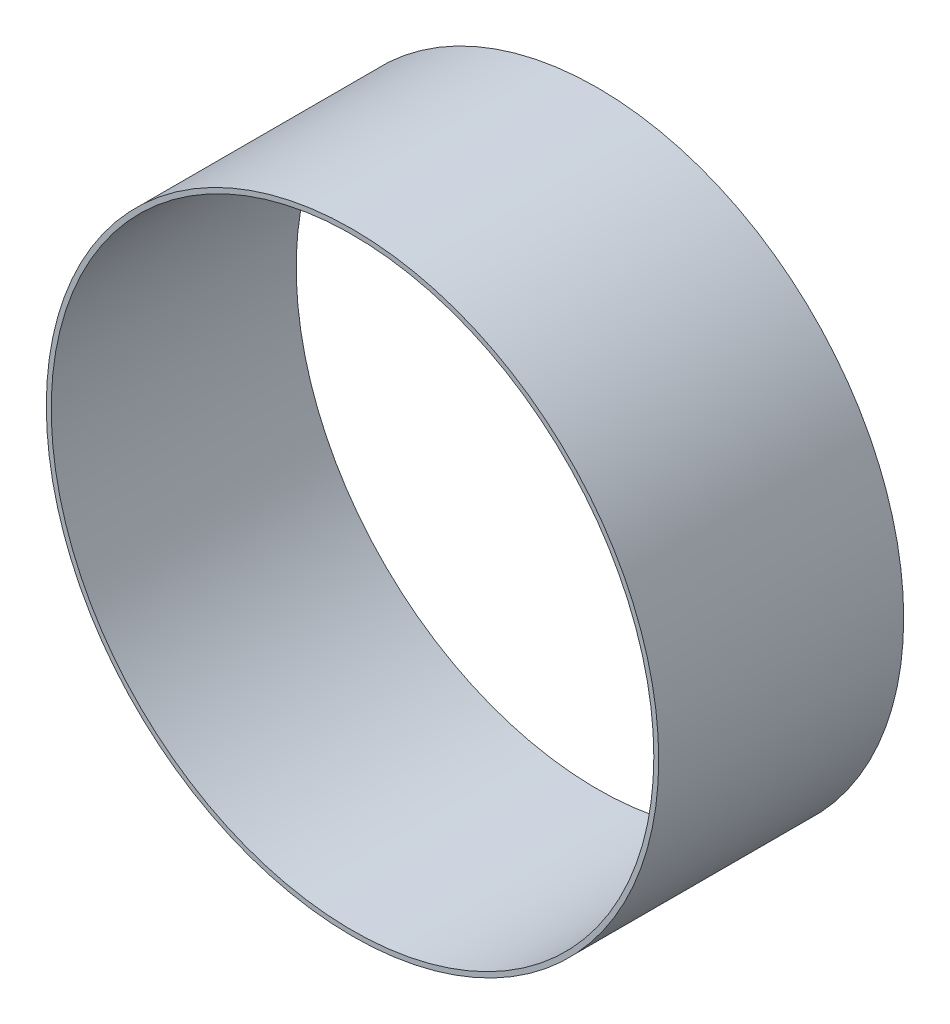
ISO-10303-21;
HEADER;
FILE_DESCRIPTION(('STEP AP214'),'2;1');
FILE_NAME('part.step','',(''),(''),'','','');
FILE_SCHEMA(('AUTOMOTIVE_DESIGN { 1 0 10303 214 1 1 1 1 }'));
ENDSEC;
DATA;
#1=APPLICATION_CONTEXT('core data for automotive mechanical design processes');
#2=APPLICATION_PROTOCOL_DEFINITION('international standard','automotive_design',2000,#1);
#3=PRODUCT_CONTEXT('',#1,'mechanical');
#4=PRODUCT('Part','Part','',(#3));
#5=PRODUCT_RELATED_PRODUCT_CATEGORY('part','',(#4));
#6=PRODUCT_DEFINITION_FORMATION('','',#4);
#7=PRODUCT_DEFINITION_CONTEXT('part definition',#1,'design');
#8=PRODUCT_DEFINITION('design','',#6,#7);
#9=PRODUCT_DEFINITION_SHAPE('','',#8);
#10=(LENGTH_UNIT() NAMED_UNIT(*) SI_UNIT(.MILLI.,.METRE.));
#11=(NAMED_UNIT(*) PLANE_ANGLE_UNIT() SI_UNIT($,.RADIAN.));
#12=(NAMED_UNIT(*) SI_UNIT($,.STERADIAN.) SOLID_ANGLE_UNIT());
#13=UNCERTAINTY_MEASURE_WITH_UNIT(LENGTH_MEASURE(1.E-05),#10,'distance_accuracy_value','');
#14=(GEOMETRIC_REPRESENTATION_CONTEXT(3) GLOBAL_UNCERTAINTY_ASSIGNED_CONTEXT((#13)) GLOBAL_UNIT_ASSIGNED_CONTEXT((#10,
#11,#12)) REPRESENTATION_CONTEXT('',''));
#15=CARTESIAN_POINT('',(0.,0.,0.));
#16=DIRECTION('',(0.,0.,1.));
#17=DIRECTION('',(1.,0.,0.));
#18=AXIS2_PLACEMENT_3D('',#15,#16,#17);
#19=CARTESIAN_POINT('',(0.,0.,100.));
#20=DIRECTION('',(0.,0.,1.));
#21=DIRECTION('',(1.,0.,0.));
#22=AXIS2_PLACEMENT_3D('',#19,#20,#21);
#23=PLANE('',#22);
#24=CARTESIAN_POINT('',(0.,0.,100.));
#25=DIRECTION('',(0.,0.,1.));
#26=DIRECTION('',(1.,0.,0.));
#27=AXIS2_PLACEMENT_3D('',#24,#25,#26);
#28=CIRCLE('',#27,125.);
#29=CARTESIAN_POINT('',(125.,0.,100.));
#30=VERTEX_POINT('',#29);
#31=EDGE_CURVE('E10',#30,#30,#28,.T.);
#32=ORIENTED_EDGE('',*,*,#31,.T.);
#33=EDGE_LOOP('',(#32));
#34=FACE_BOUND('',#33,.T.);
#35=CARTESIAN_POINT('',(0.,0.,100.));
#36=DIRECTION('',(0.,0.,1.));
#37=DIRECTION('',(1.,0.,0.));
#38=AXIS2_PLACEMENT_3D('',#35,#36,#37);
#39=CIRCLE('',#38,123.);
#40=CARTESIAN_POINT('',(123.,0.,100.));
#41=VERTEX_POINT('',#40);
#42=EDGE_CURVE('E45',#41,#41,#39,.T.);
#43=ORIENTED_EDGE('',*,*,#42,.F.);
#44=EDGE_LOOP('',(#43));
#45=FACE_BOUND('',#44,.T.);
#46=ADVANCED_FACE('F34',(#34,#45),#23,.T.);
#47=CARTESIAN_POINT('',(0.,0.,0.));
#48=DIRECTION('',(0.,0.,1.));
#49=DIRECTION('',(1.,0.,0.));
#50=AXIS2_PLACEMENT_3D('',#47,#48,#49);
#51=PLANE('',#50);
#52=CARTESIAN_POINT('',(0.,0.,0.));
#53=DIRECTION('',(0.,0.,1.));
#54=DIRECTION('',(1.,0.,0.));
#55=AXIS2_PLACEMENT_3D('',#52,#53,#54);
#56=CIRCLE('',#55,125.);
#57=CARTESIAN_POINT('',(125.,0.,0.));
#58=VERTEX_POINT('',#57);
#59=EDGE_CURVE('E38',#58,#58,#56,.T.);
#60=ORIENTED_EDGE('',*,*,#59,.F.);
#61=EDGE_LOOP('',(#60));
#62=FACE_BOUND('',#61,.T.);
#63=CARTESIAN_POINT('',(0.,0.,0.));
#64=DIRECTION('',(0.,0.,1.));
#65=DIRECTION('',(1.,0.,0.));
#66=AXIS2_PLACEMENT_3D('',#63,#64,#65);
#67=CIRCLE('',#66,123.);
#68=CARTESIAN_POINT('',(123.,0.,0.));
#69=VERTEX_POINT('',#68);
#70=EDGE_CURVE('E47',#69,#69,#67,.T.);
#71=ORIENTED_EDGE('',*,*,#70,.T.);
#72=EDGE_LOOP('',(#71));
#73=FACE_BOUND('',#72,.T.);
#74=ADVANCED_FACE('F57',(#62,#73),#51,.F.);
#75=CARTESIAN_POINT('',(0.,0.,100.));
#76=DIRECTION('',(0.,0.,-1.));
#77=DIRECTION('',(-1.,0.,0.));
#78=AXIS2_PLACEMENT_3D('',#75,#76,#77);
#79=CYLINDRICAL_SURFACE('',#78,125.);
#80=ORIENTED_EDGE('',*,*,#31,.F.);
#81=EDGE_LOOP('',(#80));
#82=FACE_BOUND('',#81,.T.);
#83=ORIENTED_EDGE('',*,*,#59,.T.);
#84=EDGE_LOOP('',(#83));
#85=FACE_BOUND('',#84,.T.);
#86=ADVANCED_FACE('F36',(#82,#85),#79,.T.);
#87=CARTESIAN_POINT('',(0.,0.,100.));
#88=DIRECTION('',(0.,0.,-1.));
#89=DIRECTION('',(-1.,0.,0.));
#90=AXIS2_PLACEMENT_3D('',#87,#88,#89);
#91=CYLINDRICAL_SURFACE('',#90,123.);
#92=ORIENTED_EDGE('',*,*,#42,.T.);
#93=EDGE_LOOP('',(#92));
#94=FACE_BOUND('',#93,.T.);
#95=ORIENTED_EDGE('',*,*,#70,.F.);
#96=EDGE_LOOP('',(#95));
#97=FACE_BOUND('',#96,.T.);
#98=ADVANCED_FACE('F53',(#94,#97),#91,.F.);
#99=CLOSED_SHELL('',(#46,#74,#86,#98));
#100=MANIFOLD_SOLID_BREP('B2',#99);
#101=ADVANCED_BREP_SHAPE_REPRESENTATION('',(#18,#100),#14);
#102=SHAPE_DEFINITION_REPRESENTATION(#9,#101);
ENDSEC;
END-ISO-10303-21;
